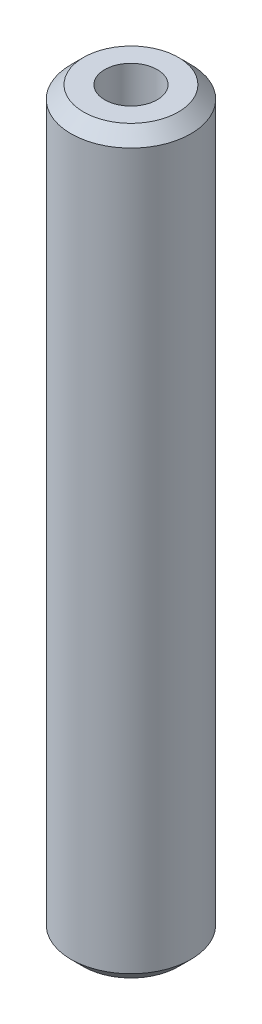
ISO-10303-21;
HEADER;
FILE_DESCRIPTION(('STEP AP214'),'2;1');
FILE_NAME('part.step','',(''),(''),'','','');
FILE_SCHEMA(('AUTOMOTIVE_DESIGN { 1 0 10303 214 1 1 1 1 }'));
ENDSEC;
DATA;
#1=APPLICATION_CONTEXT('core data for automotive mechanical design processes');
#2=APPLICATION_PROTOCOL_DEFINITION('international standard','automotive_design',2000,#1);
#3=PRODUCT_CONTEXT('',#1,'mechanical');
#4=PRODUCT('Part','Part','',(#3));
#5=PRODUCT_RELATED_PRODUCT_CATEGORY('part','',(#4));
#6=PRODUCT_DEFINITION_FORMATION('','',#4);
#7=PRODUCT_DEFINITION_CONTEXT('part definition',#1,'design');
#8=PRODUCT_DEFINITION('design','',#6,#7);
#9=PRODUCT_DEFINITION_SHAPE('','',#8);
#10=(LENGTH_UNIT() NAMED_UNIT(*) SI_UNIT(.MILLI.,.METRE.));
#11=(NAMED_UNIT(*) PLANE_ANGLE_UNIT() SI_UNIT($,.RADIAN.));
#12=(NAMED_UNIT(*) SI_UNIT($,.STERADIAN.) SOLID_ANGLE_UNIT());
#13=UNCERTAINTY_MEASURE_WITH_UNIT(LENGTH_MEASURE(1.E-05),#10,'distance_accuracy_value','');
#14=(GEOMETRIC_REPRESENTATION_CONTEXT(3) GLOBAL_UNCERTAINTY_ASSIGNED_CONTEXT((#13)) GLOBAL_UNIT_ASSIGNED_CONTEXT((#10,
#11,#12)) REPRESENTATION_CONTEXT('',''));
#15=CARTESIAN_POINT('',(0.,0.,0.));
#16=DIRECTION('',(0.,0.,1.));
#17=DIRECTION('',(1.,0.,0.));
#18=AXIS2_PLACEMENT_3D('',#15,#16,#17);
#19=CARTESIAN_POINT('',(0.,123.483005153195,0.));
#20=DIRECTION('',(0.,-1.,0.));
#21=DIRECTION('',(0.,0.,-1.));
#22=AXIS2_PLACEMENT_3D('',#19,#20,#21);
#23=CYLINDRICAL_SURFACE('',#22,10.);
#24=CARTESIAN_POINT('',(0.,121.386167236296,0.));
#25=DIRECTION('',(0.,1.,0.));
#26=DIRECTION('',(0.,0.,1.));
#27=AXIS2_PLACEMENT_3D('',#24,#25,#26);
#28=CIRCLE('',#27,10.);
#29=CARTESIAN_POINT('',(0.,121.386167236296,10.));
#30=VERTEX_POINT('',#29);
#31=EDGE_CURVE('E50',#30,#30,#28,.F.);
#32=ORIENTED_EDGE('',*,*,#31,.T.);
#33=EDGE_LOOP('',(#32));
#34=FACE_BOUND('',#33,.T.);
#35=CARTESIAN_POINT('',(0.,2.09683791689919,0.));
#36=DIRECTION('',(0.,1.,0.));
#37=DIRECTION('',(0.,0.,1.));
#38=AXIS2_PLACEMENT_3D('',#35,#36,#37);
#39=CIRCLE('',#38,10.);
#40=CARTESIAN_POINT('',(0.,2.09683791689919,10.));
#41=VERTEX_POINT('',#40);
#42=EDGE_CURVE('E51',#41,#41,#39,.T.);
#43=ORIENTED_EDGE('',*,*,#42,.T.);
#44=EDGE_LOOP('',(#43));
#45=FACE_BOUND('',#44,.T.);
#46=ADVANCED_FACE('F39',(#34,#45),#23,.T.);
#47=CARTESIAN_POINT('',(0.,123.483005153195,0.));
#48=DIRECTION('',(0.,1.,0.));
#49=DIRECTION('',(0.,0.,1.));
#50=AXIS2_PLACEMENT_3D('',#47,#48,#49);
#51=PLANE('',#50);
#52=CARTESIAN_POINT('',(0.,123.483005153195,0.));
#53=DIRECTION('',(0.,1.,0.));
#54=DIRECTION('',(0.,0.,1.));
#55=AXIS2_PLACEMENT_3D('',#52,#53,#54);
#56=CIRCLE('',#55,7.90316208310078);
#57=CARTESIAN_POINT('',(0.,123.483005153195,7.90316208310078));
#58=VERTEX_POINT('',#57);
#59=EDGE_CURVE('E54',#58,#58,#56,.T.);
#60=ORIENTED_EDGE('',*,*,#59,.T.);
#61=EDGE_LOOP('',(#60));
#62=FACE_BOUND('',#61,.T.);
#63=CARTESIAN_POINT('',(0.,123.483005153195,0.));
#64=DIRECTION('',(0.,1.,0.));
#65=DIRECTION('',(0.,0.,1.));
#66=AXIS2_PLACEMENT_3D('',#63,#64,#65);
#67=CIRCLE('',#66,4.37614148343708);
#68=CARTESIAN_POINT('',(0.,123.483005153195,4.37614148343708));
#69=VERTEX_POINT('',#68);
#70=EDGE_CURVE('E58',#69,#69,#67,.T.);
#71=ORIENTED_EDGE('',*,*,#70,.F.);
#72=EDGE_LOOP('',(#71));
#73=FACE_BOUND('',#72,.T.);
#74=ADVANCED_FACE('F69',(#62,#73),#51,.T.);
#75=CARTESIAN_POINT('',(0.,0.,0.));
#76=DIRECTION('',(0.,1.,0.));
#77=DIRECTION('',(0.,0.,1.));
#78=AXIS2_PLACEMENT_3D('',#75,#76,#77);
#79=PLANE('',#78);
#80=CARTESIAN_POINT('',(0.,0.,0.));
#81=DIRECTION('',(0.,1.,0.));
#82=DIRECTION('',(0.,0.,1.));
#83=AXIS2_PLACEMENT_3D('',#80,#81,#82);
#84=CIRCLE('',#83,7.9031620831008);
#85=CARTESIAN_POINT('',(0.,0.,7.9031620831008));
#86=VERTEX_POINT('',#85);
#87=EDGE_CURVE('E10',#86,#86,#84,.F.);
#88=ORIENTED_EDGE('',*,*,#87,.T.);
#89=EDGE_LOOP('',(#88));
#90=FACE_BOUND('',#89,.T.);
#91=CARTESIAN_POINT('',(0.,0.,0.));
#92=DIRECTION('',(0.,1.,0.));
#93=DIRECTION('',(0.,0.,1.));
#94=AXIS2_PLACEMENT_3D('',#91,#92,#93);
#95=CIRCLE('',#94,4.37614148343708);
#96=CARTESIAN_POINT('',(0.,0.,4.37614148343708));
#97=VERTEX_POINT('',#96);
#98=EDGE_CURVE('E63',#97,#97,#95,.T.);
#99=ORIENTED_EDGE('',*,*,#98,.T.);
#100=EDGE_LOOP('',(#99));
#101=FACE_BOUND('',#100,.T.);
#102=ADVANCED_FACE('F75',(#90,#101),#79,.F.);
#103=CARTESIAN_POINT('',(0.,123.483005153195,0.));
#104=DIRECTION('',(0.,-1.,0.));
#105=DIRECTION('',(0.,0.,-1.));
#106=AXIS2_PLACEMENT_3D('',#103,#104,#105);
#107=CYLINDRICAL_SURFACE('',#106,4.37614148343708);
#108=ORIENTED_EDGE('',*,*,#70,.T.);
#109=EDGE_LOOP('',(#108));
#110=FACE_BOUND('',#109,.T.);
#111=ORIENTED_EDGE('',*,*,#98,.F.);
#112=EDGE_LOOP('',(#111));
#113=FACE_BOUND('',#112,.T.);
#114=ADVANCED_FACE('F70',(#110,#113),#107,.F.);
#115=CARTESIAN_POINT('',(0.,123.483005153195,0.));
#116=DIRECTION('',(0.,-1.,0.));
#117=DIRECTION('',(0.,0.,-1.));
#118=AXIS2_PLACEMENT_3D('',#115,#116,#117);
#119=CONICAL_SURFACE('',#118,7.90316208310078,0.78539816339745);
#120=ORIENTED_EDGE('',*,*,#31,.F.);
#121=EDGE_LOOP('',(#120));
#122=FACE_BOUND('',#121,.T.);
#123=ORIENTED_EDGE('',*,*,#59,.F.);
#124=EDGE_LOOP('',(#123));
#125=FACE_BOUND('',#124,.T.);
#126=ADVANCED_FACE('F81',(#122,#125),#119,.T.);
#127=CARTESIAN_POINT('',(0.,2.09683791689919,0.));
#128=DIRECTION('',(0.,1.,0.));
#129=DIRECTION('',(0.,0.,1.));
#130=AXIS2_PLACEMENT_3D('',#127,#128,#129);
#131=CONICAL_SURFACE('',#130,10.,0.785398163397453);
#132=ORIENTED_EDGE('',*,*,#87,.F.);
#133=EDGE_LOOP('',(#132));
#134=FACE_BOUND('',#133,.T.);
#135=ORIENTED_EDGE('',*,*,#42,.F.);
#136=EDGE_LOOP('',(#135));
#137=FACE_BOUND('',#136,.T.);
#138=ADVANCED_FACE('F45',(#134,#137),#131,.T.);
#139=CLOSED_SHELL('',(#46,#74,#102,#114,#126,#138));
#140=MANIFOLD_SOLID_BREP('B2',#139);
#141=ADVANCED_BREP_SHAPE_REPRESENTATION('',(#18,#140),#14);
#142=SHAPE_DEFINITION_REPRESENTATION(#9,#141);
ENDSEC;
END-ISO-10303-21;
